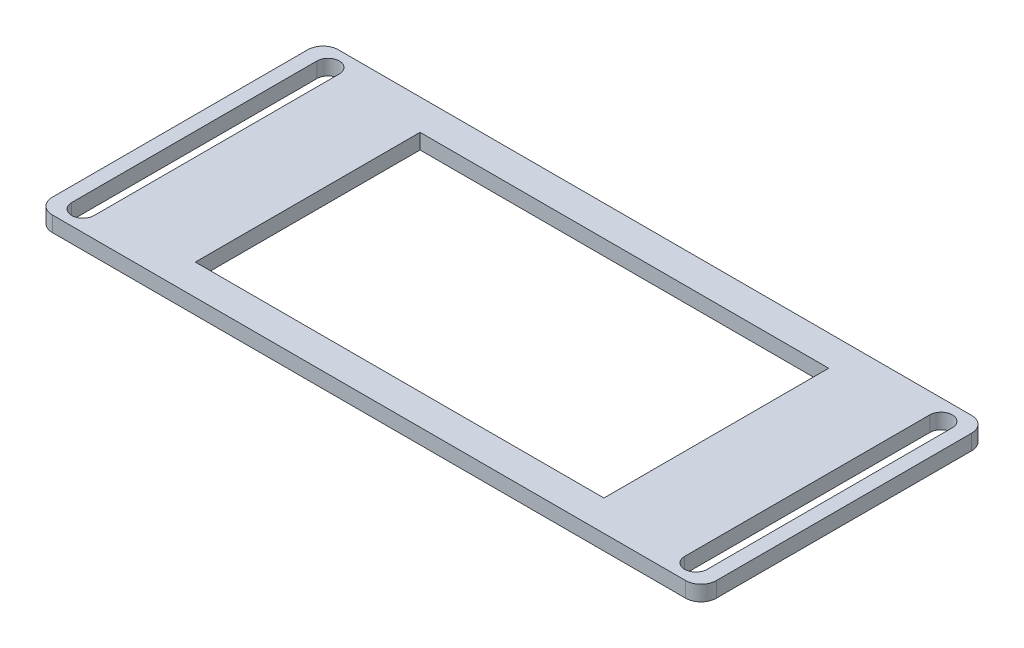
ISO-10303-21;
HEADER;
FILE_DESCRIPTION(('STEP AP214'),'2;1');
FILE_NAME('part.step','',(''),(''),'','','');
FILE_SCHEMA(('AUTOMOTIVE_DESIGN { 1 0 10303 214 1 1 1 1 }'));
ENDSEC;
DATA;
#1=APPLICATION_CONTEXT('core data for automotive mechanical design processes');
#2=APPLICATION_PROTOCOL_DEFINITION('international standard','automotive_design',2000,#1);
#3=PRODUCT_CONTEXT('',#1,'mechanical');
#4=PRODUCT('Part','Part','',(#3));
#5=PRODUCT_RELATED_PRODUCT_CATEGORY('part','',(#4));
#6=PRODUCT_DEFINITION_FORMATION('','',#4);
#7=PRODUCT_DEFINITION_CONTEXT('part definition',#1,'design');
#8=PRODUCT_DEFINITION('design','',#6,#7);
#9=PRODUCT_DEFINITION_SHAPE('','',#8);
#10=(LENGTH_UNIT() NAMED_UNIT(*) SI_UNIT(.MILLI.,.METRE.));
#11=(NAMED_UNIT(*) PLANE_ANGLE_UNIT() SI_UNIT($,.RADIAN.));
#12=(NAMED_UNIT(*) SI_UNIT($,.STERADIAN.) SOLID_ANGLE_UNIT());
#13=UNCERTAINTY_MEASURE_WITH_UNIT(LENGTH_MEASURE(1.E-05),#10,'distance_accuracy_value','');
#14=(GEOMETRIC_REPRESENTATION_CONTEXT(3) GLOBAL_UNCERTAINTY_ASSIGNED_CONTEXT((#13)) GLOBAL_UNIT_ASSIGNED_CONTEXT((#10,
#11,#12)) REPRESENTATION_CONTEXT('',''));
#15=CARTESIAN_POINT('',(0.,0.,0.));
#16=DIRECTION('',(0.,0.,1.));
#17=DIRECTION('',(1.,0.,0.));
#18=AXIS2_PLACEMENT_3D('',#15,#16,#17);
#19=CARTESIAN_POINT('',(0.,1.5,0.));
#20=DIRECTION('',(0.,-1.,0.));
#21=DIRECTION('',(0.,0.,-1.));
#22=AXIS2_PLACEMENT_3D('',#19,#20,#21);
#23=PLANE('',#22);
#24=DIRECTION('',(0.,0.,-1.));
#25=VECTOR('',#24,1.);
#26=CARTESIAN_POINT('',(31.1,1.5,12.));
#27=LINE('',#26,#25);
#28=CARTESIAN_POINT('',(31.1,1.5,12.));
#29=VERTEX_POINT('',#28);
#30=CARTESIAN_POINT('',(31.1,1.5,-12.));
#31=VERTEX_POINT('',#30);
#32=EDGE_CURVE('E205',#29,#31,#27,.T.);
#33=ORIENTED_EDGE('',*,*,#32,.F.);
#34=CARTESIAN_POINT('',(30.,1.5,12.));
#35=DIRECTION('',(0.,1.,0.));
#36=DIRECTION('',(0.,0.,-1.));
#37=AXIS2_PLACEMENT_3D('',#34,#35,#36);
#38=CIRCLE('',#37,1.10000000000001);
#39=CARTESIAN_POINT('',(28.9,1.5,12.));
#40=VERTEX_POINT('',#39);
#41=EDGE_CURVE('E178',#40,#29,#38,.T.);
#42=ORIENTED_EDGE('',*,*,#41,.F.);
#43=DIRECTION('',(0.,0.,1.));
#44=VECTOR('',#43,1.);
#45=CARTESIAN_POINT('',(28.9,1.5,12.));
#46=LINE('',#45,#44);
#47=CARTESIAN_POINT('',(28.9,1.5,-12.));
#48=VERTEX_POINT('',#47);
#49=EDGE_CURVE('E196',#48,#40,#46,.T.);
#50=ORIENTED_EDGE('',*,*,#49,.F.);
#51=CARTESIAN_POINT('',(30.,1.5,-12.));
#52=DIRECTION('',(0.,1.,0.));
#53=DIRECTION('',(0.,0.,-1.));
#54=AXIS2_PLACEMENT_3D('',#51,#52,#53);
#55=CIRCLE('',#54,1.10000000000001);
#56=EDGE_CURVE('E199',#31,#48,#55,.T.);
#57=ORIENTED_EDGE('',*,*,#56,.F.);
#58=EDGE_LOOP('',(#33,#42,#50,#57));
#59=FACE_BOUND('',#58,.T.);
#60=DIRECTION('',(0.,0.,-1.));
#61=VECTOR('',#60,1.);
#62=CARTESIAN_POINT('',(-28.9,1.5,12.));
#63=LINE('',#62,#61);
#64=CARTESIAN_POINT('',(-28.9,1.5,12.));
#65=VERTEX_POINT('',#64);
#66=CARTESIAN_POINT('',(-28.9,1.5,-12.));
#67=VERTEX_POINT('',#66);
#68=EDGE_CURVE('E230',#65,#67,#63,.T.);
#69=ORIENTED_EDGE('',*,*,#68,.F.);
#70=CARTESIAN_POINT('',(-30.,1.5,12.));
#71=DIRECTION('',(0.,1.,0.));
#72=DIRECTION('',(0.,0.,1.));
#73=AXIS2_PLACEMENT_3D('',#70,#71,#72);
#74=CIRCLE('',#73,1.1);
#75=CARTESIAN_POINT('',(-31.1,1.5,12.));
#76=VERTEX_POINT('',#75);
#77=EDGE_CURVE('E211',#76,#65,#74,.T.);
#78=ORIENTED_EDGE('',*,*,#77,.F.);
#79=DIRECTION('',(0.,0.,1.));
#80=VECTOR('',#79,1.);
#81=CARTESIAN_POINT('',(-31.1,1.5,12.));
#82=LINE('',#81,#80);
#83=CARTESIAN_POINT('',(-31.1,1.5,-12.));
#84=VERTEX_POINT('',#83);
#85=EDGE_CURVE('E219',#84,#76,#82,.T.);
#86=ORIENTED_EDGE('',*,*,#85,.F.);
#87=CARTESIAN_POINT('',(-30.,1.5,-12.));
#88=DIRECTION('',(0.,1.,0.));
#89=DIRECTION('',(0.,0.,1.));
#90=AXIS2_PLACEMENT_3D('',#87,#88,#89);
#91=CIRCLE('',#90,1.1);
#92=EDGE_CURVE('E233',#67,#84,#91,.T.);
#93=ORIENTED_EDGE('',*,*,#92,.F.);
#94=EDGE_LOOP('',(#69,#78,#86,#93));
#95=FACE_BOUND('',#94,.T.);
#96=DIRECTION('',(1.,0.,0.));
#97=VECTOR('',#96,1.);
#98=CARTESIAN_POINT('',(-32.5,1.5,14.));
#99=LINE('',#98,#97);
#100=CARTESIAN_POINT('',(-31.,1.5,14.));
#101=VERTEX_POINT('',#100);
#102=CARTESIAN_POINT('',(31.,1.5,14.));
#103=VERTEX_POINT('',#102);
#104=EDGE_CURVE('E286',#101,#103,#99,.T.);
#105=ORIENTED_EDGE('',*,*,#104,.T.);
#106=CARTESIAN_POINT('',(31.,1.5,12.5));
#107=DIRECTION('',(0.,-1.,0.));
#108=DIRECTION('',(0.,0.,-1.));
#109=AXIS2_PLACEMENT_3D('',#106,#107,#108);
#110=CIRCLE('',#109,1.5);
#111=CARTESIAN_POINT('',(32.5,1.5,12.5));
#112=VERTEX_POINT('',#111);
#113=EDGE_CURVE('E321',#103,#112,#110,.F.);
#114=ORIENTED_EDGE('',*,*,#113,.T.);
#115=DIRECTION('',(0.,0.,-1.));
#116=VECTOR('',#115,1.);
#117=CARTESIAN_POINT('',(32.5,1.5,14.));
#118=LINE('',#117,#116);
#119=CARTESIAN_POINT('',(32.5,1.5,-12.5));
#120=VERTEX_POINT('',#119);
#121=EDGE_CURVE('E278',#112,#120,#118,.T.);
#122=ORIENTED_EDGE('',*,*,#121,.T.);
#123=CARTESIAN_POINT('',(31.,1.5,-12.5));
#124=DIRECTION('',(0.,-1.,0.));
#125=DIRECTION('',(0.,0.,-1.));
#126=AXIS2_PLACEMENT_3D('',#123,#124,#125);
#127=CIRCLE('',#126,1.5);
#128=CARTESIAN_POINT('',(31.,1.5,-14.));
#129=VERTEX_POINT('',#128);
#130=EDGE_CURVE('E317',#120,#129,#127,.F.);
#131=ORIENTED_EDGE('',*,*,#130,.T.);
#132=DIRECTION('',(-1.,0.,0.));
#133=VECTOR('',#132,1.);
#134=CARTESIAN_POINT('',(-32.5,1.5,-14.));
#135=LINE('',#134,#133);
#136=CARTESIAN_POINT('',(-31.,1.5,-14.));
#137=VERTEX_POINT('',#136);
#138=EDGE_CURVE('E281',#129,#137,#135,.T.);
#139=ORIENTED_EDGE('',*,*,#138,.T.);
#140=CARTESIAN_POINT('',(-31.,1.5,-12.5));
#141=DIRECTION('',(0.,-1.,0.));
#142=DIRECTION('',(0.,0.,-1.));
#143=AXIS2_PLACEMENT_3D('',#140,#141,#142);
#144=CIRCLE('',#143,1.5);
#145=CARTESIAN_POINT('',(-32.5,1.5,-12.5));
#146=VERTEX_POINT('',#145);
#147=EDGE_CURVE('E54',#137,#146,#144,.F.);
#148=ORIENTED_EDGE('',*,*,#147,.T.);
#149=DIRECTION('',(0.,0.,1.));
#150=VECTOR('',#149,1.);
#151=CARTESIAN_POINT('',(-32.5,1.5,14.));
#152=LINE('',#151,#150);
#153=CARTESIAN_POINT('',(-32.5,1.5,12.5));
#154=VERTEX_POINT('',#153);
#155=EDGE_CURVE('E284',#146,#154,#152,.T.);
#156=ORIENTED_EDGE('',*,*,#155,.T.);
#157=CARTESIAN_POINT('',(-31.,1.5,12.5));
#158=DIRECTION('',(0.,-1.,0.));
#159=DIRECTION('',(0.,0.,-1.));
#160=AXIS2_PLACEMENT_3D('',#157,#158,#159);
#161=CIRCLE('',#160,1.5);
#162=EDGE_CURVE('E319',#154,#101,#161,.F.);
#163=ORIENTED_EDGE('',*,*,#162,.T.);
#164=EDGE_LOOP('',(#105,#114,#122,#131,#139,#148,#156,#163));
#165=FACE_BOUND('',#164,.T.);
#166=DIRECTION('',(0.,0.,-1.));
#167=VECTOR('',#166,1.);
#168=CARTESIAN_POINT('',(20.,1.5,11.));
#169=LINE('',#168,#167);
#170=CARTESIAN_POINT('',(20.,1.5,11.));
#171=VERTEX_POINT('',#170);
#172=CARTESIAN_POINT('',(20.,1.5,-11.));
#173=VERTEX_POINT('',#172);
#174=EDGE_CURVE('E247',#171,#173,#169,.T.);
#175=ORIENTED_EDGE('',*,*,#174,.F.);
#176=DIRECTION('',(1.,0.,0.));
#177=VECTOR('',#176,1.);
#178=CARTESIAN_POINT('',(-20.,1.5,11.));
#179=LINE('',#178,#177);
#180=CARTESIAN_POINT('',(-20.,1.5,11.));
#181=VERTEX_POINT('',#180);
#182=EDGE_CURVE('E255',#181,#171,#179,.T.);
#183=ORIENTED_EDGE('',*,*,#182,.F.);
#184=DIRECTION('',(0.,0.,1.));
#185=VECTOR('',#184,1.);
#186=CARTESIAN_POINT('',(-20.,1.5,11.));
#187=LINE('',#186,#185);
#188=CARTESIAN_POINT('',(-20.,1.5,-11.));
#189=VERTEX_POINT('',#188);
#190=EDGE_CURVE('E252',#189,#181,#187,.T.);
#191=ORIENTED_EDGE('',*,*,#190,.F.);
#192=DIRECTION('',(-1.,0.,0.));
#193=VECTOR('',#192,1.);
#194=CARTESIAN_POINT('',(-20.,1.5,-11.));
#195=LINE('',#194,#193);
#196=EDGE_CURVE('E249',#173,#189,#195,.T.);
#197=ORIENTED_EDGE('',*,*,#196,.F.);
#198=EDGE_LOOP('',(#175,#183,#191,#197));
#199=FACE_BOUND('',#198,.T.);
#200=ADVANCED_FACE('F32',(#59,#95,#165,#199),#23,.F.);
#201=CARTESIAN_POINT('',(0.,0.,0.));
#202=DIRECTION('',(0.,-1.,0.));
#203=DIRECTION('',(0.,0.,-1.));
#204=AXIS2_PLACEMENT_3D('',#201,#202,#203);
#205=PLANE('',#204);
#206=CARTESIAN_POINT('',(30.,0.,12.));
#207=DIRECTION('',(0.,1.,0.));
#208=DIRECTION('',(0.,0.,-1.));
#209=AXIS2_PLACEMENT_3D('',#206,#207,#208);
#210=CIRCLE('',#209,1.10000000000001);
#211=CARTESIAN_POINT('',(28.9,0.,12.));
#212=VERTEX_POINT('',#211);
#213=CARTESIAN_POINT('',(31.1,0.,12.));
#214=VERTEX_POINT('',#213);
#215=EDGE_CURVE('E175',#212,#214,#210,.T.);
#216=ORIENTED_EDGE('',*,*,#215,.T.);
#217=DIRECTION('',(0.,0.,-1.));
#218=VECTOR('',#217,1.);
#219=CARTESIAN_POINT('',(31.1,0.,12.));
#220=LINE('',#219,#218);
#221=CARTESIAN_POINT('',(31.1,0.,-12.));
#222=VERTEX_POINT('',#221);
#223=EDGE_CURVE('E187',#214,#222,#220,.T.);
#224=ORIENTED_EDGE('',*,*,#223,.T.);
#225=CARTESIAN_POINT('',(30.,0.,-12.));
#226=DIRECTION('',(0.,1.,0.));
#227=DIRECTION('',(0.,0.,-1.));
#228=AXIS2_PLACEMENT_3D('',#225,#226,#227);
#229=CIRCLE('',#228,1.10000000000001);
#230=CARTESIAN_POINT('',(28.9,0.,-12.));
#231=VERTEX_POINT('',#230);
#232=EDGE_CURVE('E191',#222,#231,#229,.T.);
#233=ORIENTED_EDGE('',*,*,#232,.T.);
#234=DIRECTION('',(0.,0.,1.));
#235=VECTOR('',#234,1.);
#236=CARTESIAN_POINT('',(28.9,0.,12.));
#237=LINE('',#236,#235);
#238=EDGE_CURVE('E183',#231,#212,#237,.T.);
#239=ORIENTED_EDGE('',*,*,#238,.T.);
#240=EDGE_LOOP('',(#216,#224,#233,#239));
#241=FACE_BOUND('',#240,.T.);
#242=CARTESIAN_POINT('',(-30.,0.,12.));
#243=DIRECTION('',(0.,1.,0.));
#244=DIRECTION('',(0.,0.,1.));
#245=AXIS2_PLACEMENT_3D('',#242,#243,#244);
#246=CIRCLE('',#245,1.1);
#247=CARTESIAN_POINT('',(-31.1,0.,12.));
#248=VERTEX_POINT('',#247);
#249=CARTESIAN_POINT('',(-28.9,0.,12.));
#250=VERTEX_POINT('',#249);
#251=EDGE_CURVE('E215',#248,#250,#246,.T.);
#252=ORIENTED_EDGE('',*,*,#251,.T.);
#253=DIRECTION('',(0.,0.,-1.));
#254=VECTOR('',#253,1.);
#255=CARTESIAN_POINT('',(-28.9,0.,12.));
#256=LINE('',#255,#254);
#257=CARTESIAN_POINT('',(-28.9,0.,-12.));
#258=VERTEX_POINT('',#257);
#259=EDGE_CURVE('E218',#250,#258,#256,.T.);
#260=ORIENTED_EDGE('',*,*,#259,.T.);
#261=CARTESIAN_POINT('',(-30.,0.,-12.));
#262=DIRECTION('',(0.,1.,0.));
#263=DIRECTION('',(0.,0.,1.));
#264=AXIS2_PLACEMENT_3D('',#261,#262,#263);
#265=CIRCLE('',#264,1.1);
#266=CARTESIAN_POINT('',(-31.1,0.,-12.));
#267=VERTEX_POINT('',#266);
#268=EDGE_CURVE('E222',#258,#267,#265,.T.);
#269=ORIENTED_EDGE('',*,*,#268,.T.);
#270=DIRECTION('',(0.,0.,1.));
#271=VECTOR('',#270,1.);
#272=CARTESIAN_POINT('',(-31.1,0.,12.));
#273=LINE('',#272,#271);
#274=EDGE_CURVE('E225',#267,#248,#273,.T.);
#275=ORIENTED_EDGE('',*,*,#274,.T.);
#276=EDGE_LOOP('',(#252,#260,#269,#275));
#277=FACE_BOUND('',#276,.T.);
#278=DIRECTION('',(0.,0.,-1.));
#279=VECTOR('',#278,1.);
#280=CARTESIAN_POINT('',(32.5,0.,14.));
#281=LINE('',#280,#279);
#282=CARTESIAN_POINT('',(32.5,0.,12.5));
#283=VERTEX_POINT('',#282);
#284=CARTESIAN_POINT('',(32.5,0.,-12.5));
#285=VERTEX_POINT('',#284);
#286=EDGE_CURVE('E277',#283,#285,#281,.T.);
#287=ORIENTED_EDGE('',*,*,#286,.F.);
#288=CARTESIAN_POINT('',(31.,0.,12.5));
#289=DIRECTION('',(0.,-1.,0.));
#290=DIRECTION('',(0.,0.,-1.));
#291=AXIS2_PLACEMENT_3D('',#288,#289,#290);
#292=CIRCLE('',#291,1.5);
#293=CARTESIAN_POINT('',(31.,0.,14.));
#294=VERTEX_POINT('',#293);
#295=EDGE_CURVE('E309',#283,#294,#292,.T.);
#296=ORIENTED_EDGE('',*,*,#295,.T.);
#297=DIRECTION('',(1.,0.,0.));
#298=VECTOR('',#297,1.);
#299=CARTESIAN_POINT('',(-32.5,0.,14.));
#300=LINE('',#299,#298);
#301=CARTESIAN_POINT('',(-31.,0.,14.));
#302=VERTEX_POINT('',#301);
#303=EDGE_CURVE('E282',#302,#294,#300,.T.);
#304=ORIENTED_EDGE('',*,*,#303,.F.);
#305=CARTESIAN_POINT('',(-31.,0.,12.5));
#306=DIRECTION('',(0.,-1.,0.));
#307=DIRECTION('',(0.,0.,-1.));
#308=AXIS2_PLACEMENT_3D('',#305,#306,#307);
#309=CIRCLE('',#308,1.5);
#310=CARTESIAN_POINT('',(-32.5,0.,12.5));
#311=VERTEX_POINT('',#310);
#312=EDGE_CURVE('E307',#302,#311,#309,.T.);
#313=ORIENTED_EDGE('',*,*,#312,.T.);
#314=DIRECTION('',(0.,0.,1.));
#315=VECTOR('',#314,1.);
#316=CARTESIAN_POINT('',(-32.5,0.,14.));
#317=LINE('',#316,#315);
#318=CARTESIAN_POINT('',(-32.5,0.,-12.5));
#319=VERTEX_POINT('',#318);
#320=EDGE_CURVE('E295',#319,#311,#317,.T.);
#321=ORIENTED_EDGE('',*,*,#320,.F.);
#322=CARTESIAN_POINT('',(-31.,0.,-12.5));
#323=DIRECTION('',(0.,-1.,0.));
#324=DIRECTION('',(0.,0.,-1.));
#325=AXIS2_PLACEMENT_3D('',#322,#323,#324);
#326=CIRCLE('',#325,1.5);
#327=CARTESIAN_POINT('',(-31.,0.,-14.));
#328=VERTEX_POINT('',#327);
#329=EDGE_CURVE('E303',#319,#328,#326,.T.);
#330=ORIENTED_EDGE('',*,*,#329,.T.);
#331=DIRECTION('',(-1.,0.,0.));
#332=VECTOR('',#331,1.);
#333=CARTESIAN_POINT('',(-32.5,0.,-14.));
#334=LINE('',#333,#332);
#335=CARTESIAN_POINT('',(31.,0.,-14.));
#336=VERTEX_POINT('',#335);
#337=EDGE_CURVE('E292',#336,#328,#334,.T.);
#338=ORIENTED_EDGE('',*,*,#337,.F.);
#339=CARTESIAN_POINT('',(31.,0.,-12.5));
#340=DIRECTION('',(0.,-1.,0.));
#341=DIRECTION('',(0.,0.,-1.));
#342=AXIS2_PLACEMENT_3D('',#339,#340,#341);
#343=CIRCLE('',#342,1.5);
#344=EDGE_CURVE('E305',#336,#285,#343,.T.);
#345=ORIENTED_EDGE('',*,*,#344,.T.);
#346=EDGE_LOOP('',(#287,#296,#304,#313,#321,#330,#338,#345));
#347=FACE_BOUND('',#346,.T.);
#348=DIRECTION('',(1.,0.,0.));
#349=VECTOR('',#348,1.);
#350=CARTESIAN_POINT('',(-20.,0.,11.));
#351=LINE('',#350,#349);
#352=CARTESIAN_POINT('',(-20.,0.,11.));
#353=VERTEX_POINT('',#352);
#354=CARTESIAN_POINT('',(20.,0.,11.));
#355=VERTEX_POINT('',#354);
#356=EDGE_CURVE('E250',#353,#355,#351,.T.);
#357=ORIENTED_EDGE('',*,*,#356,.T.);
#358=DIRECTION('',(0.,0.,-1.));
#359=VECTOR('',#358,1.);
#360=CARTESIAN_POINT('',(20.,0.,11.));
#361=LINE('',#360,#359);
#362=CARTESIAN_POINT('',(20.,0.,-11.));
#363=VERTEX_POINT('',#362);
#364=EDGE_CURVE('E240',#355,#363,#361,.T.);
#365=ORIENTED_EDGE('',*,*,#364,.T.);
#366=DIRECTION('',(-1.,0.,0.));
#367=VECTOR('',#366,1.);
#368=CARTESIAN_POINT('',(-20.,0.,-11.));
#369=LINE('',#368,#367);
#370=CARTESIAN_POINT('',(-20.,0.,-11.));
#371=VERTEX_POINT('',#370);
#372=EDGE_CURVE('E260',#363,#371,#369,.T.);
#373=ORIENTED_EDGE('',*,*,#372,.T.);
#374=DIRECTION('',(0.,0.,1.));
#375=VECTOR('',#374,1.);
#376=CARTESIAN_POINT('',(-20.,0.,11.));
#377=LINE('',#376,#375);
#378=EDGE_CURVE('E263',#371,#353,#377,.T.);
#379=ORIENTED_EDGE('',*,*,#378,.T.);
#380=EDGE_LOOP('',(#357,#365,#373,#379));
#381=FACE_BOUND('',#380,.T.);
#382=ADVANCED_FACE('F193',(#241,#277,#347,#381),#205,.T.);
#383=CARTESIAN_POINT('',(32.5,1.5,14.));
#384=DIRECTION('',(-1.,0.,0.));
#385=DIRECTION('',(0.,0.,1.));
#386=AXIS2_PLACEMENT_3D('',#383,#384,#385);
#387=PLANE('',#386);
#388=ORIENTED_EDGE('',*,*,#121,.F.);
#389=DIRECTION('',(0.,-1.,0.));
#390=VECTOR('',#389,1.);
#391=CARTESIAN_POINT('',(32.5,1.5,12.5));
#392=LINE('',#391,#390);
#393=EDGE_CURVE('E300',#112,#283,#392,.T.);
#394=ORIENTED_EDGE('',*,*,#393,.T.);
#395=ORIENTED_EDGE('',*,*,#286,.T.);
#396=DIRECTION('',(0.,-1.,0.));
#397=VECTOR('',#396,1.);
#398=CARTESIAN_POINT('',(32.5,1.5,-12.5));
#399=LINE('',#398,#397);
#400=EDGE_CURVE('E289',#285,#120,#399,.F.);
#401=ORIENTED_EDGE('',*,*,#400,.T.);
#402=EDGE_LOOP('',(#388,#394,#395,#401));
#403=FACE_BOUND('',#402,.T.);
#404=ADVANCED_FACE('F356',(#403),#387,.F.);
#405=CARTESIAN_POINT('',(-32.5,1.5,-14.));
#406=DIRECTION('',(0.,0.,1.));
#407=DIRECTION('',(1.,0.,0.));
#408=AXIS2_PLACEMENT_3D('',#405,#406,#407);
#409=PLANE('',#408);
#410=ORIENTED_EDGE('',*,*,#138,.F.);
#411=DIRECTION('',(0.,-1.,0.));
#412=VECTOR('',#411,1.);
#413=CARTESIAN_POINT('',(31.,1.5,-14.));
#414=LINE('',#413,#412);
#415=EDGE_CURVE('E11',#129,#336,#414,.T.);
#416=ORIENTED_EDGE('',*,*,#415,.T.);
#417=ORIENTED_EDGE('',*,*,#337,.T.);
#418=DIRECTION('',(0.,-1.,0.));
#419=VECTOR('',#418,1.);
#420=CARTESIAN_POINT('',(-31.,1.5,-14.));
#421=LINE('',#420,#419);
#422=EDGE_CURVE('E40',#328,#137,#421,.F.);
#423=ORIENTED_EDGE('',*,*,#422,.T.);
#424=EDGE_LOOP('',(#410,#416,#417,#423));
#425=FACE_BOUND('',#424,.T.);
#426=ADVANCED_FACE('F329',(#425),#409,.F.);
#427=CARTESIAN_POINT('',(-32.5,1.5,14.));
#428=DIRECTION('',(1.,0.,0.));
#429=DIRECTION('',(0.,0.,-1.));
#430=AXIS2_PLACEMENT_3D('',#427,#428,#429);
#431=PLANE('',#430);
#432=ORIENTED_EDGE('',*,*,#320,.T.);
#433=DIRECTION('',(0.,-1.,0.));
#434=VECTOR('',#433,1.);
#435=CARTESIAN_POINT('',(-32.5,1.5,12.5));
#436=LINE('',#435,#434);
#437=EDGE_CURVE('E47',#311,#154,#436,.F.);
#438=ORIENTED_EDGE('',*,*,#437,.T.);
#439=ORIENTED_EDGE('',*,*,#155,.F.);
#440=DIRECTION('',(0.,-1.,0.));
#441=VECTOR('',#440,1.);
#442=CARTESIAN_POINT('',(-32.5,1.5,-12.5));
#443=LINE('',#442,#441);
#444=EDGE_CURVE('E323',#146,#319,#443,.T.);
#445=ORIENTED_EDGE('',*,*,#444,.T.);
#446=EDGE_LOOP('',(#432,#438,#439,#445));
#447=FACE_BOUND('',#446,.T.);
#448=ADVANCED_FACE('F337',(#447),#431,.F.);
#449=CARTESIAN_POINT('',(-32.5,1.5,14.));
#450=DIRECTION('',(0.,0.,-1.));
#451=DIRECTION('',(-1.,0.,0.));
#452=AXIS2_PLACEMENT_3D('',#449,#450,#451);
#453=PLANE('',#452);
#454=ORIENTED_EDGE('',*,*,#303,.T.);
#455=DIRECTION('',(0.,-1.,0.));
#456=VECTOR('',#455,1.);
#457=CARTESIAN_POINT('',(31.,1.5,14.));
#458=LINE('',#457,#456);
#459=EDGE_CURVE('E314',#294,#103,#458,.F.);
#460=ORIENTED_EDGE('',*,*,#459,.T.);
#461=ORIENTED_EDGE('',*,*,#104,.F.);
#462=DIRECTION('',(0.,-1.,0.));
#463=VECTOR('',#462,1.);
#464=CARTESIAN_POINT('',(-31.,1.5,14.));
#465=LINE('',#464,#463);
#466=EDGE_CURVE('E311',#101,#302,#465,.T.);
#467=ORIENTED_EDGE('',*,*,#466,.T.);
#468=EDGE_LOOP('',(#454,#460,#461,#467));
#469=FACE_BOUND('',#468,.T.);
#470=ADVANCED_FACE('F348',(#469),#453,.F.);
#471=CARTESIAN_POINT('',(20.,1.5,11.));
#472=DIRECTION('',(-1.,0.,0.));
#473=DIRECTION('',(0.,0.,1.));
#474=AXIS2_PLACEMENT_3D('',#471,#472,#473);
#475=PLANE('',#474);
#476=ORIENTED_EDGE('',*,*,#364,.F.);
#477=DIRECTION('',(0.,-1.,0.));
#478=VECTOR('',#477,1.);
#479=CARTESIAN_POINT('',(20.,1.5,11.));
#480=LINE('',#479,#478);
#481=EDGE_CURVE('E257',#171,#355,#480,.T.);
#482=ORIENTED_EDGE('',*,*,#481,.F.);
#483=ORIENTED_EDGE('',*,*,#174,.T.);
#484=DIRECTION('',(0.,-1.,0.));
#485=VECTOR('',#484,1.);
#486=CARTESIAN_POINT('',(20.,1.5,-11.));
#487=LINE('',#486,#485);
#488=EDGE_CURVE('E274',#173,#363,#487,.T.);
#489=ORIENTED_EDGE('',*,*,#488,.T.);
#490=EDGE_LOOP('',(#476,#482,#483,#489));
#491=FACE_BOUND('',#490,.T.);
#492=ADVANCED_FACE('F375',(#491),#475,.T.);
#493=CARTESIAN_POINT('',(-20.,1.5,-11.));
#494=DIRECTION('',(0.,0.,1.));
#495=DIRECTION('',(1.,0.,0.));
#496=AXIS2_PLACEMENT_3D('',#493,#494,#495);
#497=PLANE('',#496);
#498=ORIENTED_EDGE('',*,*,#372,.F.);
#499=ORIENTED_EDGE('',*,*,#488,.F.);
#500=ORIENTED_EDGE('',*,*,#196,.T.);
#501=DIRECTION('',(0.,-1.,0.));
#502=VECTOR('',#501,1.);
#503=CARTESIAN_POINT('',(-20.,1.5,-11.));
#504=LINE('',#503,#502);
#505=EDGE_CURVE('E272',#189,#371,#504,.T.);
#506=ORIENTED_EDGE('',*,*,#505,.T.);
#507=EDGE_LOOP('',(#498,#499,#500,#506));
#508=FACE_BOUND('',#507,.T.);
#509=ADVANCED_FACE('F424',(#508),#497,.T.);
#510=CARTESIAN_POINT('',(-20.,1.5,11.));
#511=DIRECTION('',(1.,0.,0.));
#512=DIRECTION('',(0.,0.,-1.));
#513=AXIS2_PLACEMENT_3D('',#510,#511,#512);
#514=PLANE('',#513);
#515=ORIENTED_EDGE('',*,*,#378,.F.);
#516=ORIENTED_EDGE('',*,*,#505,.F.);
#517=ORIENTED_EDGE('',*,*,#190,.T.);
#518=DIRECTION('',(0.,-1.,0.));
#519=VECTOR('',#518,1.);
#520=CARTESIAN_POINT('',(-20.,1.5,11.));
#521=LINE('',#520,#519);
#522=EDGE_CURVE('E270',#181,#353,#521,.T.);
#523=ORIENTED_EDGE('',*,*,#522,.T.);
#524=EDGE_LOOP('',(#515,#516,#517,#523));
#525=FACE_BOUND('',#524,.T.);
#526=ADVANCED_FACE('F421',(#525),#514,.T.);
#527=CARTESIAN_POINT('',(-20.,1.5,11.));
#528=DIRECTION('',(0.,0.,-1.));
#529=DIRECTION('',(-1.,0.,0.));
#530=AXIS2_PLACEMENT_3D('',#527,#528,#529);
#531=PLANE('',#530);
#532=ORIENTED_EDGE('',*,*,#356,.F.);
#533=ORIENTED_EDGE('',*,*,#522,.F.);
#534=ORIENTED_EDGE('',*,*,#182,.T.);
#535=ORIENTED_EDGE('',*,*,#481,.T.);
#536=EDGE_LOOP('',(#532,#533,#534,#535));
#537=FACE_BOUND('',#536,.T.);
#538=ADVANCED_FACE('F417',(#537),#531,.T.);
#539=CARTESIAN_POINT('',(-30.,0.,12.));
#540=DIRECTION('',(0.,1.,0.));
#541=DIRECTION('',(0.,0.,1.));
#542=AXIS2_PLACEMENT_3D('',#539,#540,#541);
#543=CYLINDRICAL_SURFACE('',#542,1.1);
#544=ORIENTED_EDGE('',*,*,#77,.T.);
#545=DIRECTION('',(0.,1.,0.));
#546=VECTOR('',#545,1.);
#547=CARTESIAN_POINT('',(-28.9,0.,12.));
#548=LINE('',#547,#546);
#549=EDGE_CURVE('E228',#250,#65,#548,.T.);
#550=ORIENTED_EDGE('',*,*,#549,.F.);
#551=ORIENTED_EDGE('',*,*,#251,.F.);
#552=DIRECTION('',(0.,1.,0.));
#553=VECTOR('',#552,1.);
#554=CARTESIAN_POINT('',(-31.1,0.,12.));
#555=LINE('',#554,#553);
#556=EDGE_CURVE('E238',#248,#76,#555,.T.);
#557=ORIENTED_EDGE('',*,*,#556,.T.);
#558=EDGE_LOOP('',(#544,#550,#551,#557));
#559=FACE_BOUND('',#558,.T.);
#560=ADVANCED_FACE('F407',(#559),#543,.F.);
#561=CARTESIAN_POINT('',(-31.1,0.,12.));
#562=DIRECTION('',(-1.,0.,0.));
#563=DIRECTION('',(0.,0.,1.));
#564=AXIS2_PLACEMENT_3D('',#561,#562,#563);
#565=PLANE('',#564);
#566=ORIENTED_EDGE('',*,*,#85,.T.);
#567=ORIENTED_EDGE('',*,*,#556,.F.);
#568=ORIENTED_EDGE('',*,*,#274,.F.);
#569=DIRECTION('',(0.,1.,0.));
#570=VECTOR('',#569,1.);
#571=CARTESIAN_POINT('',(-31.1,0.,-12.));
#572=LINE('',#571,#570);
#573=EDGE_CURVE('E241',#267,#84,#572,.T.);
#574=ORIENTED_EDGE('',*,*,#573,.T.);
#575=EDGE_LOOP('',(#566,#567,#568,#574));
#576=FACE_BOUND('',#575,.T.);
#577=ADVANCED_FACE('F403',(#576),#565,.F.);
#578=CARTESIAN_POINT('',(-30.,0.,-12.));
#579=DIRECTION('',(0.,1.,0.));
#580=DIRECTION('',(0.,0.,1.));
#581=AXIS2_PLACEMENT_3D('',#578,#579,#580);
#582=CYLINDRICAL_SURFACE('',#581,1.1);
#583=ORIENTED_EDGE('',*,*,#92,.T.);
#584=ORIENTED_EDGE('',*,*,#573,.F.);
#585=ORIENTED_EDGE('',*,*,#268,.F.);
#586=DIRECTION('',(0.,1.,0.));
#587=VECTOR('',#586,1.);
#588=CARTESIAN_POINT('',(-28.9,0.,-12.));
#589=LINE('',#588,#587);
#590=EDGE_CURVE('E243',#258,#67,#589,.T.);
#591=ORIENTED_EDGE('',*,*,#590,.T.);
#592=EDGE_LOOP('',(#583,#584,#585,#591));
#593=FACE_BOUND('',#592,.T.);
#594=ADVANCED_FACE('F406',(#593),#582,.F.);
#595=CARTESIAN_POINT('',(-28.9,0.,12.));
#596=DIRECTION('',(1.,0.,0.));
#597=DIRECTION('',(0.,0.,-1.));
#598=AXIS2_PLACEMENT_3D('',#595,#596,#597);
#599=PLANE('',#598);
#600=ORIENTED_EDGE('',*,*,#68,.T.);
#601=ORIENTED_EDGE('',*,*,#590,.F.);
#602=ORIENTED_EDGE('',*,*,#259,.F.);
#603=ORIENTED_EDGE('',*,*,#549,.T.);
#604=EDGE_LOOP('',(#600,#601,#602,#603));
#605=FACE_BOUND('',#604,.T.);
#606=ADVANCED_FACE('F402',(#605),#599,.F.);
#607=CARTESIAN_POINT('',(30.,0.,12.));
#608=DIRECTION('',(0.,1.,0.));
#609=DIRECTION('',(0.,0.,1.));
#610=AXIS2_PLACEMENT_3D('',#607,#608,#609);
#611=CYLINDRICAL_SURFACE('',#610,1.10000000000001);
#612=ORIENTED_EDGE('',*,*,#41,.T.);
#613=DIRECTION('',(0.,1.,0.));
#614=VECTOR('',#613,1.);
#615=CARTESIAN_POINT('',(31.1,0.,12.));
#616=LINE('',#615,#614);
#617=EDGE_CURVE('E171',#214,#29,#616,.T.);
#618=ORIENTED_EDGE('',*,*,#617,.F.);
#619=ORIENTED_EDGE('',*,*,#215,.F.);
#620=DIRECTION('',(0.,1.,0.));
#621=VECTOR('',#620,1.);
#622=CARTESIAN_POINT('',(28.9,0.,12.));
#623=LINE('',#622,#621);
#624=EDGE_CURVE('E209',#212,#40,#623,.T.);
#625=ORIENTED_EDGE('',*,*,#624,.T.);
#626=EDGE_LOOP('',(#612,#618,#619,#625));
#627=FACE_BOUND('',#626,.T.);
#628=ADVANCED_FACE('F173',(#627),#611,.F.);
#629=CARTESIAN_POINT('',(28.9,0.,12.));
#630=DIRECTION('',(-1.,0.,0.));
#631=DIRECTION('',(0.,0.,1.));
#632=AXIS2_PLACEMENT_3D('',#629,#630,#631);
#633=PLANE('',#632);
#634=ORIENTED_EDGE('',*,*,#49,.T.);
#635=ORIENTED_EDGE('',*,*,#624,.F.);
#636=ORIENTED_EDGE('',*,*,#238,.F.);
#637=DIRECTION('',(0.,1.,0.));
#638=VECTOR('',#637,1.);
#639=CARTESIAN_POINT('',(28.9,0.,-12.));
#640=LINE('',#639,#638);
#641=EDGE_CURVE('E212',#231,#48,#640,.T.);
#642=ORIENTED_EDGE('',*,*,#641,.T.);
#643=EDGE_LOOP('',(#634,#635,#636,#642));
#644=FACE_BOUND('',#643,.T.);
#645=ADVANCED_FACE('F395',(#644),#633,.F.);
#646=CARTESIAN_POINT('',(30.,0.,-12.));
#647=DIRECTION('',(0.,1.,0.));
#648=DIRECTION('',(0.,0.,1.));
#649=AXIS2_PLACEMENT_3D('',#646,#647,#648);
#650=CYLINDRICAL_SURFACE('',#649,1.10000000000001);
#651=ORIENTED_EDGE('',*,*,#56,.T.);
#652=ORIENTED_EDGE('',*,*,#641,.F.);
#653=ORIENTED_EDGE('',*,*,#232,.F.);
#654=DIRECTION('',(0.,1.,0.));
#655=VECTOR('',#654,1.);
#656=CARTESIAN_POINT('',(31.1,0.,-12.));
#657=LINE('',#656,#655);
#658=EDGE_CURVE('E182',#222,#31,#657,.T.);
#659=ORIENTED_EDGE('',*,*,#658,.T.);
#660=EDGE_LOOP('',(#651,#652,#653,#659));
#661=FACE_BOUND('',#660,.T.);
#662=ADVANCED_FACE('F390',(#661),#650,.F.);
#663=CARTESIAN_POINT('',(31.1,0.,12.));
#664=DIRECTION('',(1.,0.,0.));
#665=DIRECTION('',(0.,0.,-1.));
#666=AXIS2_PLACEMENT_3D('',#663,#664,#665);
#667=PLANE('',#666);
#668=ORIENTED_EDGE('',*,*,#32,.T.);
#669=ORIENTED_EDGE('',*,*,#658,.F.);
#670=ORIENTED_EDGE('',*,*,#223,.F.);
#671=ORIENTED_EDGE('',*,*,#617,.T.);
#672=EDGE_LOOP('',(#668,#669,#670,#671));
#673=FACE_BOUND('',#672,.T.);
#674=ADVANCED_FACE('F188',(#673),#667,.F.);
#675=CARTESIAN_POINT('',(31.,1.5,12.5));
#676=DIRECTION('',(0.,-1.,0.));
#677=DIRECTION('',(0.,0.,-1.));
#678=AXIS2_PLACEMENT_3D('',#675,#676,#677);
#679=CYLINDRICAL_SURFACE('',#678,1.5);
#680=ORIENTED_EDGE('',*,*,#113,.F.);
#681=ORIENTED_EDGE('',*,*,#459,.F.);
#682=ORIENTED_EDGE('',*,*,#295,.F.);
#683=ORIENTED_EDGE('',*,*,#393,.F.);
#684=EDGE_LOOP('',(#680,#681,#682,#683));
#685=FACE_BOUND('',#684,.T.);
#686=ADVANCED_FACE('F354',(#685),#679,.T.);
#687=CARTESIAN_POINT('',(-31.,1.5,12.5));
#688=DIRECTION('',(0.,-1.,0.));
#689=DIRECTION('',(0.,0.,-1.));
#690=AXIS2_PLACEMENT_3D('',#687,#688,#689);
#691=CYLINDRICAL_SURFACE('',#690,1.5);
#692=ORIENTED_EDGE('',*,*,#162,.F.);
#693=ORIENTED_EDGE('',*,*,#437,.F.);
#694=ORIENTED_EDGE('',*,*,#312,.F.);
#695=ORIENTED_EDGE('',*,*,#466,.F.);
#696=EDGE_LOOP('',(#692,#693,#694,#695));
#697=FACE_BOUND('',#696,.T.);
#698=ADVANCED_FACE('F345',(#697),#691,.T.);
#699=CARTESIAN_POINT('',(31.,1.5,-12.5));
#700=DIRECTION('',(0.,-1.,0.));
#701=DIRECTION('',(0.,0.,-1.));
#702=AXIS2_PLACEMENT_3D('',#699,#700,#701);
#703=CYLINDRICAL_SURFACE('',#702,1.5);
#704=ORIENTED_EDGE('',*,*,#130,.F.);
#705=ORIENTED_EDGE('',*,*,#400,.F.);
#706=ORIENTED_EDGE('',*,*,#344,.F.);
#707=ORIENTED_EDGE('',*,*,#415,.F.);
#708=EDGE_LOOP('',(#704,#705,#706,#707));
#709=FACE_BOUND('',#708,.T.);
#710=ADVANCED_FACE('F359',(#709),#703,.T.);
#711=CARTESIAN_POINT('',(-31.,1.5,-12.5));
#712=DIRECTION('',(0.,-1.,0.));
#713=DIRECTION('',(0.,0.,-1.));
#714=AXIS2_PLACEMENT_3D('',#711,#712,#713);
#715=CYLINDRICAL_SURFACE('',#714,1.5);
#716=ORIENTED_EDGE('',*,*,#147,.F.);
#717=ORIENTED_EDGE('',*,*,#422,.F.);
#718=ORIENTED_EDGE('',*,*,#329,.F.);
#719=ORIENTED_EDGE('',*,*,#444,.F.);
#720=EDGE_LOOP('',(#716,#717,#718,#719));
#721=FACE_BOUND('',#720,.T.);
#722=ADVANCED_FACE('F34',(#721),#715,.T.);
#723=CLOSED_SHELL('',(#200,#382,#404,#426,#448,#470,#492,#509,#526,#538,#560,#577,#594,#606,
#628,#645,#662,#674,#686,#698,#710,#722));
#724=MANIFOLD_SOLID_BREP('B2',#723);
#725=ADVANCED_BREP_SHAPE_REPRESENTATION('',(#18,#724),#14);
#726=SHAPE_DEFINITION_REPRESENTATION(#9,#725);
ENDSEC;
END-ISO-10303-21;
